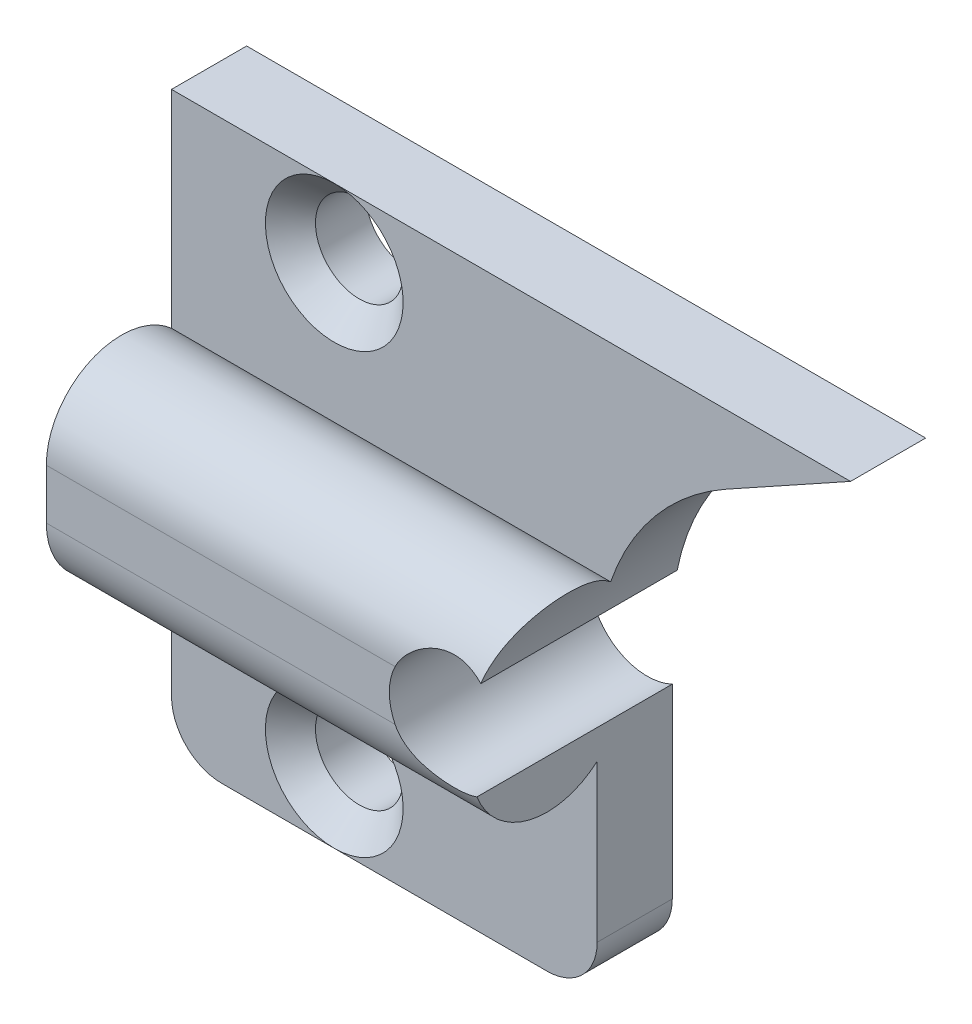
ISO-10303-21;
HEADER;
FILE_DESCRIPTION(('STEP AP214'),'2;1');
FILE_NAME('part.step','',(''),(''),'','','');
FILE_SCHEMA(('AUTOMOTIVE_DESIGN { 1 0 10303 214 1 1 1 1 }'));
ENDSEC;
DATA;
#1=APPLICATION_CONTEXT('core data for automotive mechanical design processes');
#2=APPLICATION_PROTOCOL_DEFINITION('international standard','automotive_design',2000,#1);
#3=PRODUCT_CONTEXT('',#1,'mechanical');
#4=PRODUCT('Part','Part','',(#3));
#5=PRODUCT_RELATED_PRODUCT_CATEGORY('part','',(#4));
#6=PRODUCT_DEFINITION_FORMATION('','',#4);
#7=PRODUCT_DEFINITION_CONTEXT('part definition',#1,'design');
#8=PRODUCT_DEFINITION('design','',#6,#7);
#9=PRODUCT_DEFINITION_SHAPE('','',#8);
#10=(LENGTH_UNIT() NAMED_UNIT(*) SI_UNIT(.MILLI.,.METRE.));
#11=(NAMED_UNIT(*) PLANE_ANGLE_UNIT() SI_UNIT($,.RADIAN.));
#12=(NAMED_UNIT(*) SI_UNIT($,.STERADIAN.) SOLID_ANGLE_UNIT());
#13=UNCERTAINTY_MEASURE_WITH_UNIT(LENGTH_MEASURE(1.E-05),#10,'distance_accuracy_value','');
#14=(GEOMETRIC_REPRESENTATION_CONTEXT(3) GLOBAL_UNCERTAINTY_ASSIGNED_CONTEXT((#13)) GLOBAL_UNIT_ASSIGNED_CONTEXT((#10,
#11,#12)) REPRESENTATION_CONTEXT('',''));
#15=CARTESIAN_POINT('',(0.,0.,0.));
#16=DIRECTION('',(0.,0.,1.));
#17=DIRECTION('',(1.,0.,0.));
#18=AXIS2_PLACEMENT_3D('',#15,#16,#17);
#19=CARTESIAN_POINT('',(19.,0.,3.));
#20=DIRECTION('',(0.,0.,-1.));
#21=DIRECTION('',(-1.,0.,0.));
#22=AXIS2_PLACEMENT_3D('',#19,#20,#21);
#23=CYLINDRICAL_SURFACE('',#22,2.3);
#24=CARTESIAN_POINT('',(16.9287684822792,1.,3.));
#25=CARTESIAN_POINT('',(16.9557451902013,1.05589884184006,3.00000830421828));
#26=CARTESIAN_POINT('',(16.9849915495914,1.11067336334779,2.99843806512547));
#27=CARTESIAN_POINT('',(17.0477092702206,1.21753136170321,2.99257868398128));
#28=CARTESIAN_POINT('',(17.0811767120521,1.26961727258272,2.98829204951697));
#29=CARTESIAN_POINT('',(17.1519019269945,1.37051596633264,2.97746267728579));
#30=CARTESIAN_POINT('',(17.189140618603,1.41934333888923,2.97093093283844));
#31=CARTESIAN_POINT('',(17.2672441526867,1.51370816295,2.95607631334087));
#32=CARTESIAN_POINT('',(17.3081097885407,1.55924489066771,2.94775304583223));
#33=CARTESIAN_POINT('',(17.4354493782482,1.69025437028488,2.92086758683388));
#34=CARTESIAN_POINT('',(17.5269535925054,1.77053432346075,2.90033879662134));
#35=CARTESIAN_POINT('',(17.721318458883,1.9156552309591,2.85785231387144));
#36=CARTESIAN_POINT('',(17.8241979531154,1.98046999053109,2.8358922760653));
#37=CARTESIAN_POINT('',(18.0474204346871,2.09752856635184,2.792779281421));
#38=CARTESIAN_POINT('',(18.1684949370885,2.14845997825829,2.77181130128577));
#39=CARTESIAN_POINT('',(18.4184044442738,2.22911317541224,2.73701305800484));
#40=CARTESIAN_POINT('',(18.5472298590892,2.25886060863601,2.7231741691261));
#41=CARTESIAN_POINT('',(18.8025106980058,2.29495136863609,2.70619452292101));
#42=CARTESIAN_POINT('',(18.9287832429099,2.30234919464129,2.70257230413857));
#43=CARTESIAN_POINT('',(19.1807665183444,2.29634614723616,2.70545714479396));
#44=CARTESIAN_POINT('',(19.3064770398099,2.2829380906825,2.71196770253251));
#45=CARTESIAN_POINT('',(19.5447400716548,2.23762591573363,2.73291654497484));
#46=CARTESIAN_POINT('',(19.6576039926574,2.2070519312842,2.74678112721964));
#47=CARTESIAN_POINT('',(19.876620686165,2.12955442460096,2.77954412291904));
#48=CARTESIAN_POINT('',(19.982782594938,2.08265375367347,2.79843549207382));
#49=CARTESIAN_POINT('',(20.1220064136827,2.00821043191523,2.82558965537743));
#50=CARTESIAN_POINT('',(20.158822482022,1.98719382998251,2.83301505916803));
#51=CARTESIAN_POINT('',(20.195,1.96519083042845,2.84049408745327));
#52=B_SPLINE_CURVE_WITH_KNOTS('',3,(#24,#25,#26,#27,#28,#29,#30,#31,#32,#33,#34,#35,#36,#37,#38,
#39,#40,#41,#42,#43,#44,#45,#46,#47,#48,#49,#50,#51),.UNSPECIFIED.,.F.,.F.,(4,2,2,2,2,2,2,2,2,2,
2,2,2,4),(0.,0.186094023873225,0.372016508458739,0.557041283779496,0.742106632718569,
1.11075049405047,1.48001439634577,1.87705586682551,2.27361580813558,2.6511478157121,
3.02881019362662,3.38059824548073,3.73189589113045,3.8609354760349),.UNSPECIFIED.);
#53=CARTESIAN_POINT('',(16.9287684822792,1.,3.));
#54=VERTEX_POINT('',#53);
#55=CARTESIAN_POINT('',(20.195,1.96519083042843,2.84049408745325));
#56=VERTEX_POINT('',#55);
#57=EDGE_CURVE('E12',#54,#56,#52,.T.);
#58=ORIENTED_EDGE('',*,*,#57,.F.);
#59=CARTESIAN_POINT('',(19.,0.,3.));
#60=DIRECTION('',(0.,0.,-1.));
#61=DIRECTION('',(-1.,0.,0.));
#62=AXIS2_PLACEMENT_3D('',#59,#60,#61);
#63=CIRCLE('',#62,2.3);
#64=CARTESIAN_POINT('',(16.9287684822792,-1.,3.));
#65=VERTEX_POINT('',#64);
#66=EDGE_CURVE('E292',#65,#54,#63,.T.);
#67=ORIENTED_EDGE('',*,*,#66,.F.);
#68=CARTESIAN_POINT('',(20.,-2.0712315177208,2.80222465827449));
#69=CARTESIAN_POINT('',(19.9459567784959,-2.09732684655579,2.7922431623547));
#70=CARTESIAN_POINT('',(19.8908237430107,-2.12133365293302,2.78265342142491));
#71=CARTESIAN_POINT('',(19.7786545008995,-2.16502172105805,2.76465034956416));
#72=CARTESIAN_POINT('',(19.7216174025947,-2.18470092249268,2.7562375796633));
#73=CARTESIAN_POINT('',(19.6059391454382,-2.21956900683139,2.74098773017002));
#74=CARTESIAN_POINT('',(19.5472971892583,-2.23475561178733,2.7341514503148));
#75=CARTESIAN_POINT('',(19.4288410267889,-2.26048122076926,2.72238528593673));
#76=CARTESIAN_POINT('',(19.3690270300705,-2.27102104790047,2.71745506380414));
#77=CARTESIAN_POINT('',(19.188000260597,-2.29553226678774,2.7059143624975));
#78=CARTESIAN_POINT('',(19.0654903973524,-2.30230838679264,2.70259417975062));
#79=CARTESIAN_POINT('',(18.8212994130549,-2.29629829536762,2.70547787428497));
#80=CARTESIAN_POINT('',(18.6996174042077,-2.28353817837101,2.71166904734369));
#81=CARTESIAN_POINT('',(18.4652666953547,-2.24002281697712,2.73182638250727));
#82=CARTESIAN_POINT('',(18.3524319345396,-2.21000167078298,2.74547430211551));
#83=CARTESIAN_POINT('',(18.1331302026775,-2.13355424855168,2.77790741781815));
#84=CARTESIAN_POINT('',(18.0266723200066,-2.08710518063379,2.79669974296495));
#85=CARTESIAN_POINT('',(17.8143969496755,-1.97480280270074,2.83788573767128));
#86=CARTESIAN_POINT('',(17.7092534933241,-1.90773543193479,2.86044501913152));
#87=CARTESIAN_POINT('',(17.5110679555743,-1.75742311315344,2.9038630082321));
#88=CARTESIAN_POINT('',(17.4180102616749,-1.67419939008238,2.92472389660071));
#89=CARTESIAN_POINT('',(17.2509550930469,-1.4982229430184,2.95961607844363));
#90=CARTESIAN_POINT('',(17.1761702917026,-1.40629109618787,2.97397059171458));
#91=CARTESIAN_POINT('',(17.0749043190221,-1.25998240625116,2.98911932694236));
#92=CARTESIAN_POINT('',(17.0429055443597,-1.20968339226703,2.99310685814024));
#93=CARTESIAN_POINT('',(16.9828289610733,-1.106609720869,2.99855056527616));
#94=CARTESIAN_POINT('',(16.9547545783358,-1.05383295346642,3.00000454202797));
#95=CARTESIAN_POINT('',(16.9287684822792,-1.,3.));
#96=B_SPLINE_CURVE_WITH_KNOTS('',3,(#68,#69,#70,#71,#72,#73,#74,#75,#76,#77,#78,#79,#80,#81,#82,
#83,#84,#85,#86,#87,#88,#89,#90,#91,#92,#93,#94,#95),.UNSPECIFIED.,.F.,.F.,(4,2,2,2,2,2,2,2,2,2,
2,2,2,4),(0.,0.182478880862046,0.365044450227092,0.547702430491819,0.730328042692154,
1.09647701879586,1.46213735842087,1.81328905155002,2.16492985142645,2.54351316197169,
2.92160244471142,3.27799514245934,3.45703134525153,3.63622287850397),.UNSPECIFIED.);
#97=CARTESIAN_POINT('',(20.,-2.0712315177208,2.80222465827449));
#98=VERTEX_POINT('',#97);
#99=EDGE_CURVE('E247',#98,#65,#96,.T.);
#100=ORIENTED_EDGE('',*,*,#99,.F.);
#101=DIRECTION('',(0.,0.,-1.));
#102=VECTOR('',#101,1.);
#103=CARTESIAN_POINT('',(20.,-2.0712315177208,3.));
#104=LINE('',#103,#102);
#105=CARTESIAN_POINT('',(20.,-2.0712315177208,-5.));
#106=VERTEX_POINT('',#105);
#107=EDGE_CURVE('E298',#98,#106,#104,.T.);
#108=ORIENTED_EDGE('',*,*,#107,.T.);
#109=CARTESIAN_POINT('',(19.,0.,-5.));
#110=DIRECTION('',(0.,0.,1.));
#111=DIRECTION('',(-1.,0.,0.));
#112=AXIS2_PLACEMENT_3D('',#109,#110,#111);
#113=CIRCLE('',#112,2.3);
#114=CARTESIAN_POINT('',(20.195,1.96519083042844,-5.));
#115=VERTEX_POINT('',#114);
#116=EDGE_CURVE('E349',#115,#106,#113,.T.);
#117=ORIENTED_EDGE('',*,*,#116,.F.);
#118=DIRECTION('',(0.,0.,-1.));
#119=VECTOR('',#118,1.);
#120=CARTESIAN_POINT('',(20.195,1.96519083042844,3.));
#121=LINE('',#120,#119);
#122=EDGE_CURVE('E294',#56,#115,#121,.T.);
#123=ORIENTED_EDGE('',*,*,#122,.F.);
#124=EDGE_LOOP('',(#58,#67,#100,#108,#117,#123));
#125=FACE_BOUND('',#124,.T.);
#126=ADVANCED_FACE('F69',(#125),#23,.F.);
#127=CARTESIAN_POINT('',(0.,0.,-2.));
#128=DIRECTION('',(0.,0.,1.));
#129=DIRECTION('',(1.,0.,0.));
#130=AXIS2_PLACEMENT_3D('',#127,#128,#129);
#131=PLANE('',#130);
#132=DIRECTION('',(1.,0.,0.));
#133=VECTOR('',#132,1.);
#134=CARTESIAN_POINT('',(3.,-11.5,-2.));
#135=LINE('',#134,#133);
#136=CARTESIAN_POINT('',(5.,-11.5,-2.));
#137=VERTEX_POINT('',#136);
#138=CARTESIAN_POINT('',(9.5,-11.5,-2.));
#139=VERTEX_POINT('',#138);
#140=EDGE_CURVE('E324',#137,#139,#135,.T.);
#141=ORIENTED_EDGE('',*,*,#140,.T.);
#142=CARTESIAN_POINT('',(9.5,-8.75,-2.));
#143=DIRECTION('',(0.,0.,1.));
#144=DIRECTION('',(1.,0.,0.));
#145=AXIS2_PLACEMENT_3D('',#142,#143,#144);
#146=CIRCLE('',#145,2.75);
#147=EDGE_CURVE('E388',#139,#139,#146,.F.);
#148=ORIENTED_EDGE('',*,*,#147,.T.);
#149=CARTESIAN_POINT('',(18.,-11.5,-2.));
#150=VERTEX_POINT('',#149);
#151=EDGE_CURVE('E323',#139,#150,#135,.T.);
#152=ORIENTED_EDGE('',*,*,#151,.T.);
#153=CARTESIAN_POINT('',(18.,-9.5,-2.));
#154=DIRECTION('',(0.,0.,1.));
#155=DIRECTION('',(1.,0.,0.));
#156=AXIS2_PLACEMENT_3D('',#153,#154,#155);
#157=CIRCLE('',#156,2.);
#158=CARTESIAN_POINT('',(20.,-9.5,-2.));
#159=VERTEX_POINT('',#158);
#160=EDGE_CURVE('E403',#150,#159,#157,.T.);
#161=ORIENTED_EDGE('',*,*,#160,.T.);
#162=DIRECTION('',(0.,-1.,0.));
#163=VECTOR('',#162,1.);
#164=CARTESIAN_POINT('',(20.,0.,-2.));
#165=LINE('',#164,#163);
#166=CARTESIAN_POINT('',(20.,-3.23606797749979,-2.));
#167=VERTEX_POINT('',#166);
#168=EDGE_CURVE('E305',#167,#159,#165,.T.);
#169=ORIENTED_EDGE('',*,*,#168,.F.);
#170=DIRECTION('',(-1.,0.,0.));
#171=VECTOR('',#170,1.);
#172=CARTESIAN_POINT('',(28.,-3.23606797749979,-2.));
#173=LINE('',#172,#171);
#174=CARTESIAN_POINT('',(3.,-3.23606797749979,-2.));
#175=VERTEX_POINT('',#174);
#176=EDGE_CURVE('E287',#167,#175,#173,.T.);
#177=ORIENTED_EDGE('',*,*,#176,.T.);
#178=DIRECTION('',(0.,-1.,0.));
#179=VECTOR('',#178,1.);
#180=CARTESIAN_POINT('',(3.,11.5,-2.));
#181=LINE('',#180,#179);
#182=CARTESIAN_POINT('',(3.,-9.5,-2.));
#183=VERTEX_POINT('',#182);
#184=EDGE_CURVE('E321',#175,#183,#181,.T.);
#185=ORIENTED_EDGE('',*,*,#184,.T.);
#186=CARTESIAN_POINT('',(5.,-9.5,-2.));
#187=DIRECTION('',(0.,0.,1.));
#188=DIRECTION('',(1.,0.,0.));
#189=AXIS2_PLACEMENT_3D('',#186,#187,#188);
#190=CIRCLE('',#189,2.);
#191=EDGE_CURVE('E405',#183,#137,#190,.T.);
#192=ORIENTED_EDGE('',*,*,#191,.T.);
#193=EDGE_LOOP('',(#141,#148,#152,#161,#169,#177,#185,#192));
#194=FACE_BOUND('',#193,.T.);
#195=ADVANCED_FACE('F241',(#194),#131,.T.);
#196=CARTESIAN_POINT('',(25.1519037975366,8.74619707139393,3.));
#197=DIRECTION('',(-0.484809620246341,0.874619707139394,0.));
#198=DIRECTION('',(-0.874619707139394,-0.484809620246341,0.));
#199=AXIS2_PLACEMENT_3D('',#196,#197,#198);
#200=PLANE('',#199);
#201=DIRECTION('',(0.,0.,1.));
#202=VECTOR('',#201,1.);
#203=CARTESIAN_POINT('',(30.1198957893482,11.5,2.99999999999999));
#204=LINE('',#203,#202);
#205=CARTESIAN_POINT('',(30.1198957893482,11.5,-5.));
#206=VERTEX_POINT('',#205);
#207=CARTESIAN_POINT('',(30.1198957893482,11.5,-2.));
#208=VERTEX_POINT('',#207);
#209=EDGE_CURVE('E188',#206,#208,#204,.T.);
#210=ORIENTED_EDGE('',*,*,#209,.T.);
#211=DIRECTION('',(-0.874619707139394,-0.484809620246341,0.));
#212=VECTOR('',#211,1.);
#213=CARTESIAN_POINT('',(25.1519037975366,8.74619707139393,-2.));
#214=LINE('',#213,#212);
#215=CARTESIAN_POINT('',(25.1519037975366,8.74619707139393,-2.));
#216=VERTEX_POINT('',#215);
#217=EDGE_CURVE('E201',#208,#216,#214,.T.);
#218=ORIENTED_EDGE('',*,*,#217,.T.);
#219=DIRECTION('',(0.,0.,-1.));
#220=VECTOR('',#219,1.);
#221=CARTESIAN_POINT('',(25.1519037975366,8.74619707139393,3.));
#222=LINE('',#221,#220);
#223=CARTESIAN_POINT('',(25.1519037975366,8.74619707139393,-5.));
#224=VERTEX_POINT('',#223);
#225=EDGE_CURVE('E309',#216,#224,#222,.T.);
#226=ORIENTED_EDGE('',*,*,#225,.T.);
#227=DIRECTION('',(-0.874619707139393,-0.484809620246341,0.));
#228=VECTOR('',#227,1.);
#229=CARTESIAN_POINT('',(40.5607565148914,17.2874636051264,-5.));
#230=LINE('',#229,#228);
#231=EDGE_CURVE('E190',#206,#224,#230,.T.);
#232=ORIENTED_EDGE('',*,*,#231,.F.);
#233=EDGE_LOOP('',(#210,#218,#226,#232));
#234=FACE_BOUND('',#233,.T.);
#235=ADVANCED_FACE('F243',(#234),#200,.F.);
#236=CARTESIAN_POINT('',(3.,11.5,-2.));
#237=DIRECTION('',(0.,-1.,0.));
#238=DIRECTION('',(0.,0.,-1.));
#239=AXIS2_PLACEMENT_3D('',#236,#237,#238);
#240=PLANE('',#239);
#241=DIRECTION('',(-1.,0.,0.));
#242=VECTOR('',#241,1.);
#243=CARTESIAN_POINT('',(3.,11.5,-2.));
#244=LINE('',#243,#242);
#245=CARTESIAN_POINT('',(9.49999999999999,11.5,-2.));
#246=VERTEX_POINT('',#245);
#247=EDGE_CURVE('E327',#208,#246,#244,.T.);
#248=ORIENTED_EDGE('',*,*,#247,.F.);
#249=ORIENTED_EDGE('',*,*,#209,.F.);
#250=DIRECTION('',(1.,0.,0.));
#251=VECTOR('',#250,1.);
#252=CARTESIAN_POINT('',(5.,11.5,-5.));
#253=LINE('',#252,#251);
#254=CARTESIAN_POINT('',(3.00000000000001,11.5,-5.));
#255=VERTEX_POINT('',#254);
#256=EDGE_CURVE('E90',#255,#206,#253,.T.);
#257=ORIENTED_EDGE('',*,*,#256,.F.);
#258=DIRECTION('',(0.,0.,1.));
#259=VECTOR('',#258,1.);
#260=CARTESIAN_POINT('',(3.00000000000001,11.5,-7.82842712474619));
#261=LINE('',#260,#259);
#262=CARTESIAN_POINT('',(3.00000000000001,11.5,-2.));
#263=VERTEX_POINT('',#262);
#264=EDGE_CURVE('E186',#255,#263,#261,.T.);
#265=ORIENTED_EDGE('',*,*,#264,.T.);
#266=EDGE_CURVE('E326',#246,#263,#244,.T.);
#267=ORIENTED_EDGE('',*,*,#266,.F.);
#268=EDGE_LOOP('',(#248,#249,#257,#265,#267));
#269=FACE_BOUND('',#268,.T.);
#270=ADVANCED_FACE('F184',(#269),#240,.F.);
#271=CARTESIAN_POINT('',(28.,1.,0.));
#272=DIRECTION('',(-1.,0.,0.));
#273=DIRECTION('',(0.,0.,1.));
#274=AXIS2_PLACEMENT_3D('',#271,#272,#273);
#275=CYLINDRICAL_SURFACE('',#274,3.);
#276=DIRECTION('',(-1.,0.,0.));
#277=VECTOR('',#276,1.);
#278=CARTESIAN_POINT('',(28.,0.999999999999999,3.));
#279=LINE('',#278,#277);
#280=CARTESIAN_POINT('',(3.,0.999999999999999,3.));
#281=VERTEX_POINT('',#280);
#282=EDGE_CURVE('E279',#54,#281,#279,.T.);
#283=ORIENTED_EDGE('',*,*,#282,.F.);
#284=ORIENTED_EDGE('',*,*,#57,.T.);
#285=CARTESIAN_POINT('',(20.5380834898526,3.23606797749979,-2.));
#286=CARTESIAN_POINT('',(20.5567220895078,3.29056623012108,-1.93906236706865));
#287=CARTESIAN_POINT('',(20.5750457105955,3.34260373031908,-1.87587368654494));
#288=CARTESIAN_POINT('',(20.6106976508448,3.44147668944703,-1.7452552183597));
#289=CARTESIAN_POINT('',(20.6280256577778,3.48831052073928,-1.6778241139968));
#290=CARTESIAN_POINT('',(20.6780079508335,3.62068856182053,-1.46937888348362));
#291=CARTESIAN_POINT('',(20.7085936575855,3.69791927869918,-1.3224249217212));
#292=CARTESIAN_POINT('',(20.7612488497237,3.82758824896796,-1.01611453841948));
#293=CARTESIAN_POINT('',(20.7832973966868,3.87996561648354,-0.856728761140094));
#294=CARTESIAN_POINT('',(20.8162979902268,3.95745168490276,-0.53055616557461));
#295=CARTESIAN_POINT('',(20.8272689233132,3.98260680299482,-0.363782451801071));
#296=CARTESIAN_POINT('',(20.8365852652747,4.00399185582908,-0.03711273740441));
#297=CARTESIAN_POINT('',(20.8355799274623,4.00170917541649,0.122668866633148));
#298=CARTESIAN_POINT('',(20.8226221022,3.97190024625738,0.43946143678539));
#299=CARTESIAN_POINT('',(20.8106653156252,3.94436408394258,0.596471290141652));
#300=CARTESIAN_POINT('',(20.7774830457337,3.86612384547195,0.899604389070395));
#301=CARTESIAN_POINT('',(20.7564780661457,3.81596968294,1.04589533938463));
#302=CARTESIAN_POINT('',(20.7072359874637,3.69442999460934,1.32802449827395));
#303=CARTESIAN_POINT('',(20.6789982987299,3.62304273772628,1.46386185345494));
#304=CARTESIAN_POINT('',(20.6158194691714,3.45623568503165,1.7300409922228));
#305=CARTESIAN_POINT('',(20.5805785482305,3.35963452645501,1.85956908128228));
#306=CARTESIAN_POINT('',(20.5075249427662,3.14729796186204,2.10118331395678));
#307=CARTESIAN_POINT('',(20.4697110511514,3.03155353797351,2.21326118871162));
#308=CARTESIAN_POINT('',(20.4109396832364,2.83817211450461,2.37260417471454));
#309=CARTESIAN_POINT('',(20.3898677923012,2.76610464435669,2.42672639655807));
#310=CARTESIAN_POINT('',(20.3482699601418,2.61726444534258,2.52835317921306));
#311=CARTESIAN_POINT('',(20.3277440490722,2.54049145735899,2.5758573751193));
#312=CARTESIAN_POINT('',(20.2876681248046,2.38269397407293,2.66389328116988));
#313=CARTESIAN_POINT('',(20.2681191677912,2.30166506376973,2.70441755633223));
#314=CARTESIAN_POINT('',(20.2304143117166,2.13599237774975,2.77808426329281));
#315=CARTESIAN_POINT('',(20.2122586510434,2.05134798727644,2.81122543370573));
#316=CARTESIAN_POINT('',(20.195,1.96519083042844,2.84049408745325));
#317=B_SPLINE_CURVE_WITH_KNOTS('',3,(#285,#286,#287,#288,#289,#290,#291,#292,#293,#294,#295,
#296,#297,#298,#299,#300,#301,#302,#303,#304,#305,#306,#307,#308,#309,#310,#311,#312,#313,#314,
#315,#316),.UNSPECIFIED.,.F.,.F.,(4,2,2,2,2,2,2,2,2,2,2,2,2,2,2,4),(0.,0.251412693361009,
0.502903805162635,1.00675312738152,1.51183048995194,2.01604527166251,2.49305597780554,
2.97025402062343,3.43642798338315,3.90263996263409,4.3967163949123,4.89102623957051,
5.16839394125744,5.44577693041814,5.72345358363378,6.0011776409032),.UNSPECIFIED.);
#318=CARTESIAN_POINT('',(20.5380834898526,3.23606797749979,-2.));
#319=VERTEX_POINT('',#318);
#320=EDGE_CURVE('E204',#319,#56,#317,.T.);
#321=ORIENTED_EDGE('',*,*,#320,.F.);
#322=DIRECTION('',(-1.,0.,0.));
#323=VECTOR('',#322,1.);
#324=CARTESIAN_POINT('',(28.,3.23606797749979,-2.));
#325=LINE('',#324,#323);
#326=CARTESIAN_POINT('',(3.,3.23606797749979,-2.));
#327=VERTEX_POINT('',#326);
#328=EDGE_CURVE('E319',#327,#319,#325,.F.);
#329=ORIENTED_EDGE('',*,*,#328,.F.);
#330=CARTESIAN_POINT('',(3.,1.,0.));
#331=DIRECTION('',(1.,0.,0.));
#332=DIRECTION('',(0.,0.,-1.));
#333=AXIS2_PLACEMENT_3D('',#330,#331,#332);
#334=CIRCLE('',#333,3.);
#335=EDGE_CURVE('E283',#327,#281,#334,.T.);
#336=ORIENTED_EDGE('',*,*,#335,.T.);
#337=EDGE_LOOP('',(#283,#284,#321,#329,#336));
#338=FACE_BOUND('',#337,.T.);
#339=ADVANCED_FACE('F267',(#338),#275,.T.);
#340=ORIENTED_EDGE('',*,*,#247,.T.);
#341=CARTESIAN_POINT('',(9.49999999999999,8.75,-2.));
#342=DIRECTION('',(0.,0.,1.));
#343=DIRECTION('',(1.,0.,0.));
#344=AXIS2_PLACEMENT_3D('',#341,#342,#343);
#345=CIRCLE('',#344,2.75);
#346=EDGE_CURVE('E83',#246,#246,#345,.F.);
#347=ORIENTED_EDGE('',*,*,#346,.T.);
#348=ORIENTED_EDGE('',*,*,#266,.T.);
#349=EDGE_CURVE('E195',#263,#327,#181,.T.);
#350=ORIENTED_EDGE('',*,*,#349,.T.);
#351=ORIENTED_EDGE('',*,*,#328,.T.);
#352=CARTESIAN_POINT('',(30.,0.,-2.));
#353=DIRECTION('',(0.,0.,-1.));
#354=DIRECTION('',(-1.,0.,0.));
#355=AXIS2_PLACEMENT_3D('',#352,#353,#354);
#356=CIRCLE('',#355,10.);
#357=EDGE_CURVE('E197',#319,#216,#356,.T.);
#358=ORIENTED_EDGE('',*,*,#357,.T.);
#359=ORIENTED_EDGE('',*,*,#217,.F.);
#360=EDGE_LOOP('',(#340,#347,#348,#350,#351,#358,#359));
#361=FACE_BOUND('',#360,.T.);
#362=ADVANCED_FACE('F269',(#361),#131,.T.);
#363=CARTESIAN_POINT('',(30.,0.,-2.));
#364=DIRECTION('',(0.,0.,-1.));
#365=DIRECTION('',(-1.,0.,0.));
#366=AXIS2_PLACEMENT_3D('',#363,#364,#365);
#367=CYLINDRICAL_SURFACE('',#366,10.);
#368=ORIENTED_EDGE('',*,*,#357,.F.);
#369=ORIENTED_EDGE('',*,*,#320,.T.);
#370=ORIENTED_EDGE('',*,*,#122,.T.);
#371=CARTESIAN_POINT('',(30.,0.,-5.));
#372=DIRECTION('',(0.,0.,1.));
#373=DIRECTION('',(-1.,0.,0.));
#374=AXIS2_PLACEMENT_3D('',#371,#372,#373);
#375=CIRCLE('',#374,10.);
#376=EDGE_CURVE('E336',#224,#115,#375,.T.);
#377=ORIENTED_EDGE('',*,*,#376,.F.);
#378=ORIENTED_EDGE('',*,*,#225,.F.);
#379=EDGE_LOOP('',(#368,#369,#370,#377,#378));
#380=FACE_BOUND('',#379,.T.);
#381=ADVANCED_FACE('F214',(#380),#367,.F.);
#382=CARTESIAN_POINT('',(3.,11.5,-2.));
#383=DIRECTION('',(1.,0.,0.));
#384=DIRECTION('',(0.,0.,-1.));
#385=AXIS2_PLACEMENT_3D('',#382,#383,#384);
#386=PLANE('',#385);
#387=CARTESIAN_POINT('',(3.,0.,0.));
#388=DIRECTION('',(1.,0.,0.));
#389=DIRECTION('',(0.,0.,-1.));
#390=AXIS2_PLACEMENT_3D('',#387,#388,#389);
#391=CIRCLE('',#390,1.75);
#392=CARTESIAN_POINT('',(3.,0.,-1.75));
#393=VERTEX_POINT('',#392);
#394=EDGE_CURVE('E301',#393,#393,#391,.T.);
#395=ORIENTED_EDGE('',*,*,#394,.T.);
#396=EDGE_LOOP('',(#395));
#397=FACE_BOUND('',#396,.T.);
#398=ORIENTED_EDGE('',*,*,#349,.F.);
#399=ORIENTED_EDGE('',*,*,#264,.F.);
#400=DIRECTION('',(0.,1.,0.));
#401=VECTOR('',#400,1.);
#402=CARTESIAN_POINT('',(3.,-9.5,-5.));
#403=LINE('',#402,#401);
#404=CARTESIAN_POINT('',(3.,-9.5,-5.));
#405=VERTEX_POINT('',#404);
#406=EDGE_CURVE('E173',#405,#255,#403,.T.);
#407=ORIENTED_EDGE('',*,*,#406,.F.);
#408=DIRECTION('',(0.,0.,-1.));
#409=VECTOR('',#408,1.);
#410=CARTESIAN_POINT('',(3.,-9.5,-2.));
#411=LINE('',#410,#409);
#412=EDGE_CURVE('E392',#405,#183,#411,.F.);
#413=ORIENTED_EDGE('',*,*,#412,.T.);
#414=ORIENTED_EDGE('',*,*,#184,.F.);
#415=CARTESIAN_POINT('',(3.,-1.,0.));
#416=DIRECTION('',(1.,0.,0.));
#417=DIRECTION('',(0.,0.,-1.));
#418=AXIS2_PLACEMENT_3D('',#415,#416,#417);
#419=CIRCLE('',#418,3.);
#420=CARTESIAN_POINT('',(3.,-1.,3.));
#421=VERTEX_POINT('',#420);
#422=EDGE_CURVE('E314',#421,#175,#419,.T.);
#423=ORIENTED_EDGE('',*,*,#422,.F.);
#424=DIRECTION('',(0.,-1.,0.));
#425=VECTOR('',#424,1.);
#426=CARTESIAN_POINT('',(3.,0.999999999999999,3.));
#427=LINE('',#426,#425);
#428=EDGE_CURVE('E312',#281,#421,#427,.T.);
#429=ORIENTED_EDGE('',*,*,#428,.F.);
#430=ORIENTED_EDGE('',*,*,#335,.F.);
#431=EDGE_LOOP('',(#398,#399,#407,#413,#414,#423,#429,#430));
#432=FACE_BOUND('',#431,.T.);
#433=ADVANCED_FACE('F193',(#397,#432),#386,.F.);
#434=CARTESIAN_POINT('',(3.,-11.5,-2.));
#435=DIRECTION('',(0.,1.,0.));
#436=DIRECTION('',(0.,0.,1.));
#437=AXIS2_PLACEMENT_3D('',#434,#435,#436);
#438=PLANE('',#437);
#439=DIRECTION('',(0.,0.,-1.));
#440=VECTOR('',#439,1.);
#441=CARTESIAN_POINT('',(5.,-11.5,-2.));
#442=LINE('',#441,#440);
#443=CARTESIAN_POINT('',(5.,-11.5,-5.));
#444=VERTEX_POINT('',#443);
#445=EDGE_CURVE('E255',#137,#444,#442,.T.);
#446=ORIENTED_EDGE('',*,*,#445,.T.);
#447=DIRECTION('',(-1.,0.,0.));
#448=VECTOR('',#447,1.);
#449=CARTESIAN_POINT('',(18.,-11.5,-5.));
#450=LINE('',#449,#448);
#451=CARTESIAN_POINT('',(18.,-11.5,-5.));
#452=VERTEX_POINT('',#451);
#453=EDGE_CURVE('E341',#452,#444,#450,.T.);
#454=ORIENTED_EDGE('',*,*,#453,.F.);
#455=DIRECTION('',(0.,0.,1.));
#456=VECTOR('',#455,1.);
#457=CARTESIAN_POINT('',(18.,-11.5,-2.));
#458=LINE('',#457,#456);
#459=EDGE_CURVE('E406',#452,#150,#458,.T.);
#460=ORIENTED_EDGE('',*,*,#459,.T.);
#461=ORIENTED_EDGE('',*,*,#151,.F.);
#462=ORIENTED_EDGE('',*,*,#140,.F.);
#463=EDGE_LOOP('',(#446,#454,#460,#461,#462));
#464=FACE_BOUND('',#463,.T.);
#465=ADVANCED_FACE('F361',(#464),#438,.F.);
#466=CARTESIAN_POINT('',(9.49999999999999,8.75,-2.));
#467=DIRECTION('',(0.,0.,-1.));
#468=DIRECTION('',(-1.,0.,0.));
#469=AXIS2_PLACEMENT_3D('',#466,#467,#468);
#470=CYLINDRICAL_SURFACE('',#469,1.75);
#471=CARTESIAN_POINT('',(9.49999999999999,8.75,-3.));
#472=DIRECTION('',(0.,0.,1.));
#473=DIRECTION('',(1.,0.,0.));
#474=AXIS2_PLACEMENT_3D('',#471,#472,#473);
#475=CIRCLE('',#474,1.75);
#476=CARTESIAN_POINT('',(11.25,8.75,-3.));
#477=VERTEX_POINT('',#476);
#478=EDGE_CURVE('E394',#477,#477,#475,.T.);
#479=ORIENTED_EDGE('',*,*,#478,.T.);
#480=EDGE_LOOP('',(#479));
#481=FACE_BOUND('',#480,.T.);
#482=CARTESIAN_POINT('',(9.49999999999999,8.75,-5.));
#483=DIRECTION('',(0.,0.,-1.));
#484=DIRECTION('',(-1.,0.,0.));
#485=AXIS2_PLACEMENT_3D('',#482,#483,#484);
#486=CIRCLE('',#485,1.75);
#487=CARTESIAN_POINT('',(7.74999999999999,8.75,-5.));
#488=VERTEX_POINT('',#487);
#489=EDGE_CURVE('E212',#488,#488,#486,.T.);
#490=ORIENTED_EDGE('',*,*,#489,.T.);
#491=EDGE_LOOP('',(#490));
#492=FACE_BOUND('',#491,.T.);
#493=ADVANCED_FACE('F358',(#481,#492),#470,.F.);
#494=CARTESIAN_POINT('',(9.5,-8.75,-2.));
#495=DIRECTION('',(0.,0.,-1.));
#496=DIRECTION('',(-1.,0.,0.));
#497=AXIS2_PLACEMENT_3D('',#494,#495,#496);
#498=CYLINDRICAL_SURFACE('',#497,1.75);
#499=CARTESIAN_POINT('',(9.5,-8.75,-3.));
#500=DIRECTION('',(0.,0.,1.));
#501=DIRECTION('',(1.,0.,0.));
#502=AXIS2_PLACEMENT_3D('',#499,#500,#501);
#503=CIRCLE('',#502,1.75);
#504=CARTESIAN_POINT('',(11.25,-8.75,-3.));
#505=VERTEX_POINT('',#504);
#506=EDGE_CURVE('E391',#505,#505,#503,.T.);
#507=ORIENTED_EDGE('',*,*,#506,.T.);
#508=EDGE_LOOP('',(#507));
#509=FACE_BOUND('',#508,.T.);
#510=CARTESIAN_POINT('',(9.5,-8.75,-5.));
#511=DIRECTION('',(0.,0.,-1.));
#512=DIRECTION('',(-1.,0.,0.));
#513=AXIS2_PLACEMENT_3D('',#510,#511,#512);
#514=CIRCLE('',#513,1.75);
#515=CARTESIAN_POINT('',(7.75,-8.75,-5.));
#516=VERTEX_POINT('',#515);
#517=EDGE_CURVE('E351',#516,#516,#514,.T.);
#518=ORIENTED_EDGE('',*,*,#517,.T.);
#519=EDGE_LOOP('',(#518));
#520=FACE_BOUND('',#519,.T.);
#521=ADVANCED_FACE('F265',(#509,#520),#498,.F.);
#522=CARTESIAN_POINT('',(28.,0.999999999999999,3.));
#523=DIRECTION('',(0.,0.,-1.));
#524=DIRECTION('',(0.,1.,0.));
#525=AXIS2_PLACEMENT_3D('',#522,#523,#524);
#526=PLANE('',#525);
#527=ORIENTED_EDGE('',*,*,#66,.T.);
#528=ORIENTED_EDGE('',*,*,#282,.T.);
#529=ORIENTED_EDGE('',*,*,#428,.T.);
#530=DIRECTION('',(-1.,0.,0.));
#531=VECTOR('',#530,1.);
#532=CARTESIAN_POINT('',(28.,-1.,3.));
#533=LINE('',#532,#531);
#534=EDGE_CURVE('E288',#65,#421,#533,.T.);
#535=ORIENTED_EDGE('',*,*,#534,.F.);
#536=EDGE_LOOP('',(#527,#528,#529,#535));
#537=FACE_BOUND('',#536,.T.);
#538=ADVANCED_FACE('F262',(#537),#526,.F.);
#539=CARTESIAN_POINT('',(28.,-1.,0.));
#540=DIRECTION('',(-1.,0.,0.));
#541=DIRECTION('',(0.,0.,1.));
#542=AXIS2_PLACEMENT_3D('',#539,#540,#541);
#543=CYLINDRICAL_SURFACE('',#542,3.);
#544=CARTESIAN_POINT('',(20.,-1.,0.));
#545=DIRECTION('',(-1.,0.,0.));
#546=DIRECTION('',(0.,-1.,0.));
#547=AXIS2_PLACEMENT_3D('',#544,#545,#546);
#548=CIRCLE('',#547,3.);
#549=EDGE_CURVE('E256',#167,#98,#548,.T.);
#550=ORIENTED_EDGE('',*,*,#549,.T.);
#551=ORIENTED_EDGE('',*,*,#99,.T.);
#552=ORIENTED_EDGE('',*,*,#534,.T.);
#553=ORIENTED_EDGE('',*,*,#422,.T.);
#554=ORIENTED_EDGE('',*,*,#176,.F.);
#555=EDGE_LOOP('',(#550,#551,#552,#553,#554));
#556=FACE_BOUND('',#555,.T.);
#557=ADVANCED_FACE('F236',(#556),#543,.T.);
#558=CARTESIAN_POINT('',(20.,-2.0712315177208,3.));
#559=DIRECTION('',(-1.,0.,0.));
#560=DIRECTION('',(0.,-1.,0.));
#561=AXIS2_PLACEMENT_3D('',#558,#559,#560);
#562=PLANE('',#561);
#563=ORIENTED_EDGE('',*,*,#168,.T.);
#564=DIRECTION('',(0.,0.,1.));
#565=VECTOR('',#564,1.);
#566=CARTESIAN_POINT('',(20.,-9.5,3.));
#567=LINE('',#566,#565);
#568=CARTESIAN_POINT('',(20.,-9.5,-5.));
#569=VERTEX_POINT('',#568);
#570=EDGE_CURVE('E396',#159,#569,#567,.F.);
#571=ORIENTED_EDGE('',*,*,#570,.T.);
#572=DIRECTION('',(0.,-1.,0.));
#573=VECTOR('',#572,1.);
#574=CARTESIAN_POINT('',(20.,-2.0712315177208,-5.));
#575=LINE('',#574,#573);
#576=EDGE_CURVE('E346',#106,#569,#575,.T.);
#577=ORIENTED_EDGE('',*,*,#576,.F.);
#578=ORIENTED_EDGE('',*,*,#107,.F.);
#579=ORIENTED_EDGE('',*,*,#549,.F.);
#580=EDGE_LOOP('',(#563,#571,#577,#578,#579));
#581=FACE_BOUND('',#580,.T.);
#582=ADVANCED_FACE('F233',(#581),#562,.F.);
#583=CARTESIAN_POINT('',(15.,0.,0.));
#584=DIRECTION('',(-1.,0.,0.));
#585=DIRECTION('',(0.,0.,1.));
#586=AXIS2_PLACEMENT_3D('',#583,#584,#585);
#587=CYLINDRICAL_SURFACE('',#586,1.75);
#588=CARTESIAN_POINT('',(15.,0.,0.));
#589=DIRECTION('',(1.,0.,0.));
#590=DIRECTION('',(0.,0.,-1.));
#591=AXIS2_PLACEMENT_3D('',#588,#589,#590);
#592=CIRCLE('',#591,1.75);
#593=CARTESIAN_POINT('',(15.,0.,-1.75));
#594=VERTEX_POINT('',#593);
#595=EDGE_CURVE('E296',#594,#594,#592,.T.);
#596=ORIENTED_EDGE('',*,*,#595,.T.);
#597=EDGE_LOOP('',(#596));
#598=FACE_BOUND('',#597,.T.);
#599=ORIENTED_EDGE('',*,*,#394,.F.);
#600=EDGE_LOOP('',(#599));
#601=FACE_BOUND('',#600,.T.);
#602=ADVANCED_FACE('F229',(#598,#601),#587,.F.);
#603=CARTESIAN_POINT('',(15.,0.,0.));
#604=DIRECTION('',(1.,0.,0.));
#605=DIRECTION('',(0.,0.,-1.));
#606=AXIS2_PLACEMENT_3D('',#603,#604,#605);
#607=PLANE('',#606);
#608=ORIENTED_EDGE('',*,*,#595,.F.);
#609=EDGE_LOOP('',(#608));
#610=FACE_BOUND('',#609,.T.);
#611=ADVANCED_FACE('F225',(#610),#607,.F.);
#612=CARTESIAN_POINT('',(18.,-9.5,-2.));
#613=DIRECTION('',(0.,0.,1.));
#614=DIRECTION('',(1.,0.,0.));
#615=AXIS2_PLACEMENT_3D('',#612,#613,#614);
#616=CYLINDRICAL_SURFACE('',#615,2.);
#617=ORIENTED_EDGE('',*,*,#459,.F.);
#618=CARTESIAN_POINT('',(18.,-9.5,-5.));
#619=DIRECTION('',(0.,0.,-1.));
#620=DIRECTION('',(-1.,0.,0.));
#621=AXIS2_PLACEMENT_3D('',#618,#619,#620);
#622=CIRCLE('',#621,2.);
#623=EDGE_CURVE('E343',#569,#452,#622,.T.);
#624=ORIENTED_EDGE('',*,*,#623,.F.);
#625=ORIENTED_EDGE('',*,*,#570,.F.);
#626=ORIENTED_EDGE('',*,*,#160,.F.);
#627=EDGE_LOOP('',(#617,#624,#625,#626));
#628=FACE_BOUND('',#627,.T.);
#629=ADVANCED_FACE('F228',(#628),#616,.T.);
#630=CARTESIAN_POINT('',(5.,-9.5,-2.));
#631=DIRECTION('',(0.,0.,-1.));
#632=DIRECTION('',(-1.,0.,0.));
#633=AXIS2_PLACEMENT_3D('',#630,#631,#632);
#634=CYLINDRICAL_SURFACE('',#633,2.);
#635=ORIENTED_EDGE('',*,*,#191,.F.);
#636=ORIENTED_EDGE('',*,*,#412,.F.);
#637=CARTESIAN_POINT('',(5.,-9.5,-5.));
#638=DIRECTION('',(0.,0.,-1.));
#639=DIRECTION('',(-1.,0.,0.));
#640=AXIS2_PLACEMENT_3D('',#637,#638,#639);
#641=CIRCLE('',#640,2.);
#642=EDGE_CURVE('E178',#444,#405,#641,.T.);
#643=ORIENTED_EDGE('',*,*,#642,.F.);
#644=ORIENTED_EDGE('',*,*,#445,.F.);
#645=EDGE_LOOP('',(#635,#636,#643,#644));
#646=FACE_BOUND('',#645,.T.);
#647=ADVANCED_FACE('F224',(#646),#634,.T.);
#648=CARTESIAN_POINT('',(19.,0.,-5.));
#649=DIRECTION('',(0.,0.,-1.));
#650=DIRECTION('',(-1.,0.,0.));
#651=AXIS2_PLACEMENT_3D('',#648,#649,#650);
#652=PLANE('',#651);
#653=ORIENTED_EDGE('',*,*,#256,.T.);
#654=ORIENTED_EDGE('',*,*,#231,.T.);
#655=ORIENTED_EDGE('',*,*,#376,.T.);
#656=ORIENTED_EDGE('',*,*,#116,.T.);
#657=ORIENTED_EDGE('',*,*,#576,.T.);
#658=ORIENTED_EDGE('',*,*,#623,.T.);
#659=ORIENTED_EDGE('',*,*,#453,.T.);
#660=ORIENTED_EDGE('',*,*,#642,.T.);
#661=ORIENTED_EDGE('',*,*,#406,.T.);
#662=EDGE_LOOP('',(#653,#654,#655,#656,#657,#658,#659,#660,#661));
#663=FACE_BOUND('',#662,.T.);
#664=ORIENTED_EDGE('',*,*,#517,.F.);
#665=EDGE_LOOP('',(#664));
#666=FACE_BOUND('',#665,.T.);
#667=ORIENTED_EDGE('',*,*,#489,.F.);
#668=EDGE_LOOP('',(#667));
#669=FACE_BOUND('',#668,.T.);
#670=ADVANCED_FACE('F174',(#663,#666,#669),#652,.T.);
#671=CARTESIAN_POINT('',(9.5,-8.75,-3.));
#672=DIRECTION('',(0.,0.,1.));
#673=DIRECTION('',(1.,0.,0.));
#674=AXIS2_PLACEMENT_3D('',#671,#672,#673);
#675=CONICAL_SURFACE('',#674,1.75,0.785398163397445);
#676=ORIENTED_EDGE('',*,*,#147,.F.);
#677=EDGE_LOOP('',(#676));
#678=FACE_BOUND('',#677,.T.);
#679=ORIENTED_EDGE('',*,*,#506,.F.);
#680=EDGE_LOOP('',(#679));
#681=FACE_BOUND('',#680,.T.);
#682=ADVANCED_FACE('F223',(#678,#681),#675,.F.);
#683=CARTESIAN_POINT('',(9.49999999999999,8.75,-3.));
#684=DIRECTION('',(0.,0.,1.));
#685=DIRECTION('',(1.,0.,0.));
#686=AXIS2_PLACEMENT_3D('',#683,#684,#685);
#687=CONICAL_SURFACE('',#686,1.75,0.785398163397445);
#688=ORIENTED_EDGE('',*,*,#346,.F.);
#689=EDGE_LOOP('',(#688));
#690=FACE_BOUND('',#689,.T.);
#691=ORIENTED_EDGE('',*,*,#478,.F.);
#692=EDGE_LOOP('',(#691));
#693=FACE_BOUND('',#692,.T.);
#694=ADVANCED_FACE('F71',(#690,#693),#687,.F.);
#695=CLOSED_SHELL('',(#126,#195,#235,#270,#339,#362,#381,#433,#465,#493,#521,#538,#557,#582,
#602,#611,#629,#647,#670,#682,#694));
#696=MANIFOLD_SOLID_BREP('B2',#695);
#697=ADVANCED_BREP_SHAPE_REPRESENTATION('',(#18,#696),#14);
#698=SHAPE_DEFINITION_REPRESENTATION(#9,#697);
ENDSEC;
END-ISO-10303-21;
